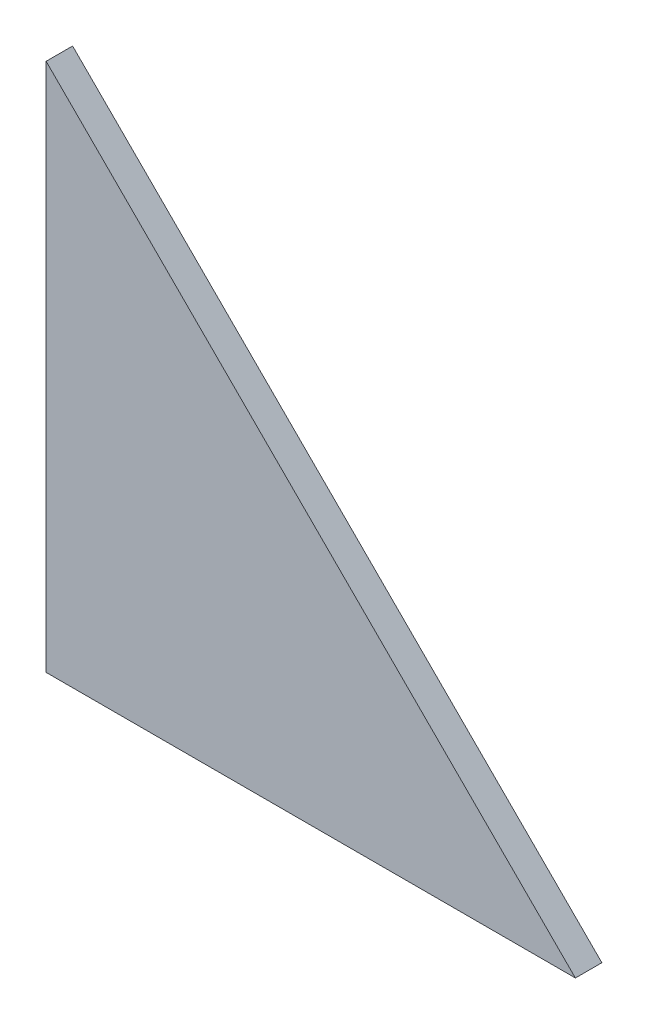
ISO-10303-21;
HEADER;
FILE_DESCRIPTION(('STEP AP214'),'2;1');
FILE_NAME('part.step','',(''),(''),'','','');
FILE_SCHEMA(('AUTOMOTIVE_DESIGN { 1 0 10303 214 1 1 1 1 }'));
ENDSEC;
DATA;
#1=APPLICATION_CONTEXT('core data for automotive mechanical design processes');
#2=APPLICATION_PROTOCOL_DEFINITION('international standard','automotive_design',2000,#1);
#3=PRODUCT_CONTEXT('',#1,'mechanical');
#4=PRODUCT('Part','Part','',(#3));
#5=PRODUCT_RELATED_PRODUCT_CATEGORY('part','',(#4));
#6=PRODUCT_DEFINITION_FORMATION('','',#4);
#7=PRODUCT_DEFINITION_CONTEXT('part definition',#1,'design');
#8=PRODUCT_DEFINITION('design','',#6,#7);
#9=PRODUCT_DEFINITION_SHAPE('','',#8);
#10=(LENGTH_UNIT() NAMED_UNIT(*) SI_UNIT(.MILLI.,.METRE.));
#11=(NAMED_UNIT(*) PLANE_ANGLE_UNIT() SI_UNIT($,.RADIAN.));
#12=(NAMED_UNIT(*) SI_UNIT($,.STERADIAN.) SOLID_ANGLE_UNIT());
#13=UNCERTAINTY_MEASURE_WITH_UNIT(LENGTH_MEASURE(1.E-05),#10,'distance_accuracy_value','');
#14=(GEOMETRIC_REPRESENTATION_CONTEXT(3) GLOBAL_UNCERTAINTY_ASSIGNED_CONTEXT((#13)) GLOBAL_UNIT_ASSIGNED_CONTEXT((#10,
#11,#12)) REPRESENTATION_CONTEXT('',''));
#15=CARTESIAN_POINT('',(0.,0.,0.));
#16=DIRECTION('',(0.,0.,1.));
#17=DIRECTION('',(1.,0.,0.));
#18=AXIS2_PLACEMENT_3D('',#15,#16,#17);
#19=CARTESIAN_POINT('',(100.,0.,5.));
#20=DIRECTION('',(0.,1.,0.));
#21=DIRECTION('',(0.,0.,1.));
#22=AXIS2_PLACEMENT_3D('',#19,#20,#21);
#23=PLANE('',#22);
#24=DIRECTION('',(1.,0.,0.));
#25=VECTOR('',#24,1.);
#26=CARTESIAN_POINT('',(100.,0.,0.));
#27=LINE('',#26,#25);
#28=CARTESIAN_POINT('',(0.,0.,0.));
#29=VERTEX_POINT('',#28);
#30=CARTESIAN_POINT('',(100.,0.,0.));
#31=VERTEX_POINT('',#30);
#32=EDGE_CURVE('E80',#29,#31,#27,.T.);
#33=ORIENTED_EDGE('',*,*,#32,.T.);
#34=DIRECTION('',(0.,0.,-1.));
#35=VECTOR('',#34,1.);
#36=CARTESIAN_POINT('',(100.,0.,5.));
#37=LINE('',#36,#35);
#38=CARTESIAN_POINT('',(100.,0.,5.));
#39=VERTEX_POINT('',#38);
#40=EDGE_CURVE('E11',#39,#31,#37,.T.);
#41=ORIENTED_EDGE('',*,*,#40,.F.);
#42=DIRECTION('',(1.,0.,0.));
#43=VECTOR('',#42,1.);
#44=CARTESIAN_POINT('',(100.,0.,5.));
#45=LINE('',#44,#43);
#46=CARTESIAN_POINT('',(0.,0.,5.));
#47=VERTEX_POINT('',#46);
#48=EDGE_CURVE('E73',#47,#39,#45,.T.);
#49=ORIENTED_EDGE('',*,*,#48,.F.);
#50=DIRECTION('',(0.,0.,-1.));
#51=VECTOR('',#50,1.);
#52=CARTESIAN_POINT('',(0.,0.,5.));
#53=LINE('',#52,#51);
#54=EDGE_CURVE('E81',#47,#29,#53,.T.);
#55=ORIENTED_EDGE('',*,*,#54,.T.);
#56=EDGE_LOOP('',(#33,#41,#49,#55));
#57=FACE_BOUND('',#56,.T.);
#58=ADVANCED_FACE('F33',(#57),#23,.F.);
#59=CARTESIAN_POINT('',(0.,100.,5.));
#60=DIRECTION('',(-0.707106781186548,-0.707106781186547,0.));
#61=DIRECTION('',(0.707106781186547,-0.707106781186548,0.));
#62=AXIS2_PLACEMENT_3D('',#59,#60,#61);
#63=PLANE('',#62);
#64=DIRECTION('',(-0.707106781186547,0.707106781186548,0.));
#65=VECTOR('',#64,1.);
#66=CARTESIAN_POINT('',(0.,100.,0.));
#67=LINE('',#66,#65);
#68=CARTESIAN_POINT('',(0.,100.,0.));
#69=VERTEX_POINT('',#68);
#70=EDGE_CURVE('E61',#31,#69,#67,.T.);
#71=ORIENTED_EDGE('',*,*,#70,.T.);
#72=DIRECTION('',(0.,0.,-1.));
#73=VECTOR('',#72,1.);
#74=CARTESIAN_POINT('',(0.,100.,5.));
#75=LINE('',#74,#73);
#76=CARTESIAN_POINT('',(0.,100.,5.));
#77=VERTEX_POINT('',#76);
#78=EDGE_CURVE('E41',#77,#69,#75,.T.);
#79=ORIENTED_EDGE('',*,*,#78,.F.);
#80=DIRECTION('',(-0.707106781186547,0.707106781186548,0.));
#81=VECTOR('',#80,1.);
#82=CARTESIAN_POINT('',(0.,100.,5.));
#83=LINE('',#82,#81);
#84=EDGE_CURVE('E69',#39,#77,#83,.T.);
#85=ORIENTED_EDGE('',*,*,#84,.F.);
#86=ORIENTED_EDGE('',*,*,#40,.T.);
#87=EDGE_LOOP('',(#71,#79,#85,#86));
#88=FACE_BOUND('',#87,.T.);
#89=ADVANCED_FACE('F70',(#88),#63,.F.);
#90=CARTESIAN_POINT('',(0.,100.,5.));
#91=DIRECTION('',(1.,0.,0.));
#92=DIRECTION('',(0.,0.,-1.));
#93=AXIS2_PLACEMENT_3D('',#90,#91,#92);
#94=PLANE('',#93);
#95=DIRECTION('',(0.,-1.,0.));
#96=VECTOR('',#95,1.);
#97=CARTESIAN_POINT('',(0.,100.,0.));
#98=LINE('',#97,#96);
#99=EDGE_CURVE('E66',#69,#29,#98,.T.);
#100=ORIENTED_EDGE('',*,*,#99,.T.);
#101=ORIENTED_EDGE('',*,*,#54,.F.);
#102=DIRECTION('',(0.,-1.,0.));
#103=VECTOR('',#102,1.);
#104=CARTESIAN_POINT('',(0.,100.,5.));
#105=LINE('',#104,#103);
#106=EDGE_CURVE('E49',#77,#47,#105,.T.);
#107=ORIENTED_EDGE('',*,*,#106,.F.);
#108=ORIENTED_EDGE('',*,*,#78,.T.);
#109=EDGE_LOOP('',(#100,#101,#107,#108));
#110=FACE_BOUND('',#109,.T.);
#111=ADVANCED_FACE('F88',(#110),#94,.F.);
#112=CARTESIAN_POINT('',(0.,0.,5.));
#113=DIRECTION('',(0.,0.,1.));
#114=DIRECTION('',(1.,0.,0.));
#115=AXIS2_PLACEMENT_3D('',#112,#113,#114);
#116=PLANE('',#115);
#117=ORIENTED_EDGE('',*,*,#48,.T.);
#118=ORIENTED_EDGE('',*,*,#84,.T.);
#119=ORIENTED_EDGE('',*,*,#106,.T.);
#120=EDGE_LOOP('',(#117,#118,#119));
#121=FACE_BOUND('',#120,.T.);
#122=ADVANCED_FACE('F76',(#121),#116,.T.);
#123=CARTESIAN_POINT('',(0.,0.,0.));
#124=DIRECTION('',(0.,0.,1.));
#125=DIRECTION('',(1.,0.,0.));
#126=AXIS2_PLACEMENT_3D('',#123,#124,#125);
#127=PLANE('',#126);
#128=ORIENTED_EDGE('',*,*,#32,.F.);
#129=ORIENTED_EDGE('',*,*,#99,.F.);
#130=ORIENTED_EDGE('',*,*,#70,.F.);
#131=EDGE_LOOP('',(#128,#129,#130));
#132=FACE_BOUND('',#131,.T.);
#133=ADVANCED_FACE('F89',(#132),#127,.F.);
#134=CLOSED_SHELL('',(#58,#89,#111,#122,#133));
#135=MANIFOLD_SOLID_BREP('B2',#134);
#136=ADVANCED_BREP_SHAPE_REPRESENTATION('',(#18,#135),#14);
#137=SHAPE_DEFINITION_REPRESENTATION(#9,#136);
ENDSEC;
END-ISO-10303-21;
